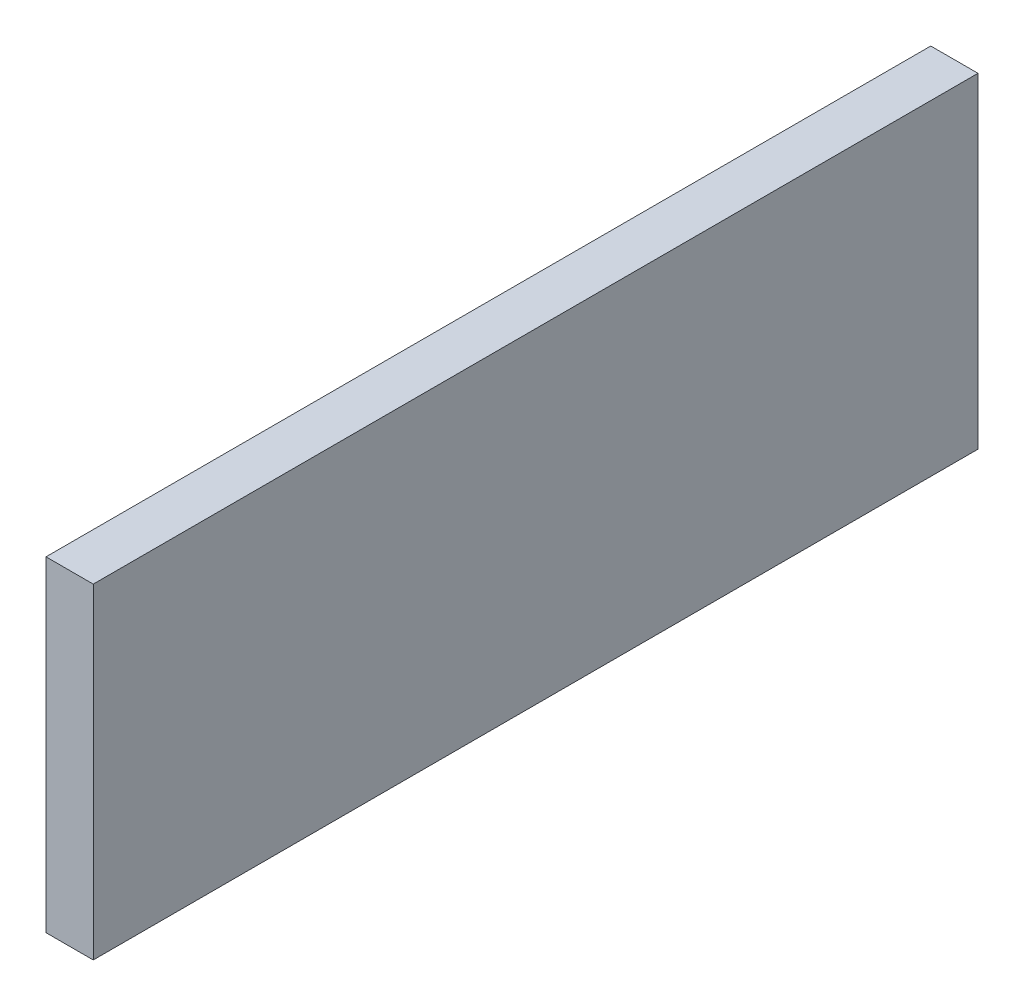
ISO-10303-21;
HEADER;
FILE_DESCRIPTION(('STEP AP214'),'2;1');
FILE_NAME('part.step','',(''),(''),'','','');
FILE_SCHEMA(('AUTOMOTIVE_DESIGN { 1 0 10303 214 1 1 1 1 }'));
ENDSEC;
DATA;
#1=APPLICATION_CONTEXT('core data for automotive mechanical design processes');
#2=APPLICATION_PROTOCOL_DEFINITION('international standard','automotive_design',2000,#1);
#3=PRODUCT_CONTEXT('',#1,'mechanical');
#4=PRODUCT('Part','Part','',(#3));
#5=PRODUCT_RELATED_PRODUCT_CATEGORY('part','',(#4));
#6=PRODUCT_DEFINITION_FORMATION('','',#4);
#7=PRODUCT_DEFINITION_CONTEXT('part definition',#1,'design');
#8=PRODUCT_DEFINITION('design','',#6,#7);
#9=PRODUCT_DEFINITION_SHAPE('','',#8);
#10=(LENGTH_UNIT() NAMED_UNIT(*) SI_UNIT(.MILLI.,.METRE.));
#11=(NAMED_UNIT(*) PLANE_ANGLE_UNIT() SI_UNIT($,.RADIAN.));
#12=(NAMED_UNIT(*) SI_UNIT($,.STERADIAN.) SOLID_ANGLE_UNIT());
#13=UNCERTAINTY_MEASURE_WITH_UNIT(LENGTH_MEASURE(1.E-05),#10,'distance_accuracy_value','');
#14=(GEOMETRIC_REPRESENTATION_CONTEXT(3) GLOBAL_UNCERTAINTY_ASSIGNED_CONTEXT((#13)) GLOBAL_UNIT_ASSIGNED_CONTEXT((#10,
#11,#12)) REPRESENTATION_CONTEXT('',''));
#15=CARTESIAN_POINT('',(0.,0.,0.));
#16=DIRECTION('',(0.,0.,1.));
#17=DIRECTION('',(1.,0.,0.));
#18=AXIS2_PLACEMENT_3D('',#15,#16,#17);
#19=CARTESIAN_POINT('',(18.,15.673494061066,31.6515286925652));
#20=DIRECTION('',(0.,0.,-1.));
#21=DIRECTION('',(0.,1.,0.));
#22=AXIS2_PLACEMENT_3D('',#19,#20,#21);
#23=PLANE('',#22);
#24=DIRECTION('',(0.,-1.,0.));
#25=VECTOR('',#24,1.);
#26=CARTESIAN_POINT('',(0.,15.673494061066,31.6515286925652));
#27=LINE('',#26,#25);
#28=CARTESIAN_POINT('',(0.,15.673494061066,31.6515286925652));
#29=VERTEX_POINT('',#28);
#30=CARTESIAN_POINT('',(0.,-108.326505938934,31.6515286925652));
#31=VERTEX_POINT('',#30);
#32=EDGE_CURVE('E98',#29,#31,#27,.T.);
#33=ORIENTED_EDGE('',*,*,#32,.T.);
#34=DIRECTION('',(-1.,0.,0.));
#35=VECTOR('',#34,1.);
#36=CARTESIAN_POINT('',(18.,-108.326505938934,31.6515286925652));
#37=LINE('',#36,#35);
#38=CARTESIAN_POINT('',(18.,-108.326505938934,31.6515286925652));
#39=VERTEX_POINT('',#38);
#40=EDGE_CURVE('E11',#39,#31,#37,.T.);
#41=ORIENTED_EDGE('',*,*,#40,.F.);
#42=DIRECTION('',(0.,-1.,0.));
#43=VECTOR('',#42,1.);
#44=CARTESIAN_POINT('',(18.,15.673494061066,31.6515286925652));
#45=LINE('',#44,#43);
#46=CARTESIAN_POINT('',(18.,15.673494061066,31.6515286925652));
#47=VERTEX_POINT('',#46);
#48=EDGE_CURVE('E86',#47,#39,#45,.T.);
#49=ORIENTED_EDGE('',*,*,#48,.F.);
#50=DIRECTION('',(-1.,0.,0.));
#51=VECTOR('',#50,1.);
#52=CARTESIAN_POINT('',(18.,15.673494061066,31.6515286925652));
#53=LINE('',#52,#51);
#54=EDGE_CURVE('E94',#47,#29,#53,.T.);
#55=ORIENTED_EDGE('',*,*,#54,.T.);
#56=EDGE_LOOP('',(#33,#41,#49,#55));
#57=FACE_BOUND('',#56,.T.);
#58=ADVANCED_FACE('F35',(#57),#23,.F.);
#59=CARTESIAN_POINT('',(18.,-108.326505938934,31.6515286925652));
#60=DIRECTION('',(0.,1.,0.));
#61=DIRECTION('',(0.,0.,1.));
#62=AXIS2_PLACEMENT_3D('',#59,#60,#61);
#63=PLANE('',#62);
#64=DIRECTION('',(0.,0.,-1.));
#65=VECTOR('',#64,1.);
#66=CARTESIAN_POINT('',(0.,-108.326505938934,31.6515286925652));
#67=LINE('',#66,#65);
#68=CARTESIAN_POINT('',(0.,-108.326505938934,-305.348471307435));
#69=VERTEX_POINT('',#68);
#70=EDGE_CURVE('E90',#31,#69,#67,.T.);
#71=ORIENTED_EDGE('',*,*,#70,.T.);
#72=DIRECTION('',(-1.,0.,0.));
#73=VECTOR('',#72,1.);
#74=CARTESIAN_POINT('',(18.,-108.326505938934,-305.348471307435));
#75=LINE('',#74,#73);
#76=CARTESIAN_POINT('',(18.,-108.326505938934,-305.348471307435));
#77=VERTEX_POINT('',#76);
#78=EDGE_CURVE('E43',#77,#69,#75,.T.);
#79=ORIENTED_EDGE('',*,*,#78,.F.);
#80=DIRECTION('',(0.,0.,-1.));
#81=VECTOR('',#80,1.);
#82=CARTESIAN_POINT('',(18.,-108.326505938934,31.6515286925652));
#83=LINE('',#82,#81);
#84=EDGE_CURVE('E81',#39,#77,#83,.T.);
#85=ORIENTED_EDGE('',*,*,#84,.F.);
#86=ORIENTED_EDGE('',*,*,#40,.T.);
#87=EDGE_LOOP('',(#71,#79,#85,#86));
#88=FACE_BOUND('',#87,.T.);
#89=ADVANCED_FACE('F89',(#88),#63,.F.);
#90=CARTESIAN_POINT('',(18.,15.673494061066,-305.348471307435));
#91=DIRECTION('',(0.,0.,1.));
#92=DIRECTION('',(1.,0.,0.));
#93=AXIS2_PLACEMENT_3D('',#90,#91,#92);
#94=PLANE('',#93);
#95=DIRECTION('',(0.,1.,0.));
#96=VECTOR('',#95,1.);
#97=CARTESIAN_POINT('',(0.,15.673494061066,-305.348471307435));
#98=LINE('',#97,#96);
#99=CARTESIAN_POINT('',(0.,15.673494061066,-305.348471307435));
#100=VERTEX_POINT('',#99);
#101=EDGE_CURVE('E68',#69,#100,#98,.T.);
#102=ORIENTED_EDGE('',*,*,#101,.T.);
#103=DIRECTION('',(-1.,0.,0.));
#104=VECTOR('',#103,1.);
#105=CARTESIAN_POINT('',(18.,15.673494061066,-305.348471307435));
#106=LINE('',#105,#104);
#107=CARTESIAN_POINT('',(18.,15.673494061066,-305.348471307435));
#108=VERTEX_POINT('',#107);
#109=EDGE_CURVE('E91',#108,#100,#106,.T.);
#110=ORIENTED_EDGE('',*,*,#109,.F.);
#111=DIRECTION('',(0.,1.,0.));
#112=VECTOR('',#111,1.);
#113=CARTESIAN_POINT('',(18.,15.673494061066,-305.348471307435));
#114=LINE('',#113,#112);
#115=EDGE_CURVE('E84',#77,#108,#114,.T.);
#116=ORIENTED_EDGE('',*,*,#115,.F.);
#117=ORIENTED_EDGE('',*,*,#78,.T.);
#118=EDGE_LOOP('',(#102,#110,#116,#117));
#119=FACE_BOUND('',#118,.T.);
#120=ADVANCED_FACE('F92',(#119),#94,.F.);
#121=CARTESIAN_POINT('',(18.,15.673494061066,31.6515286925652));
#122=DIRECTION('',(0.,-1.,0.));
#123=DIRECTION('',(0.,0.,-1.));
#124=AXIS2_PLACEMENT_3D('',#121,#122,#123);
#125=PLANE('',#124);
#126=DIRECTION('',(0.,0.,1.));
#127=VECTOR('',#126,1.);
#128=CARTESIAN_POINT('',(0.,15.673494061066,31.6515286925652));
#129=LINE('',#128,#127);
#130=EDGE_CURVE('E74',#100,#29,#129,.T.);
#131=ORIENTED_EDGE('',*,*,#130,.T.);
#132=ORIENTED_EDGE('',*,*,#54,.F.);
#133=DIRECTION('',(0.,0.,1.));
#134=VECTOR('',#133,1.);
#135=CARTESIAN_POINT('',(18.,15.673494061066,31.6515286925652));
#136=LINE('',#135,#134);
#137=EDGE_CURVE('E51',#108,#47,#136,.T.);
#138=ORIENTED_EDGE('',*,*,#137,.F.);
#139=ORIENTED_EDGE('',*,*,#109,.T.);
#140=EDGE_LOOP('',(#131,#132,#138,#139));
#141=FACE_BOUND('',#140,.T.);
#142=ADVANCED_FACE('F105',(#141),#125,.F.);
#143=CARTESIAN_POINT('',(18.,0.,0.));
#144=DIRECTION('',(1.,0.,0.));
#145=DIRECTION('',(0.,0.,-1.));
#146=AXIS2_PLACEMENT_3D('',#143,#144,#145);
#147=PLANE('',#146);
#148=ORIENTED_EDGE('',*,*,#48,.T.);
#149=ORIENTED_EDGE('',*,*,#84,.T.);
#150=ORIENTED_EDGE('',*,*,#115,.T.);
#151=ORIENTED_EDGE('',*,*,#137,.T.);
#152=EDGE_LOOP('',(#148,#149,#150,#151));
#153=FACE_BOUND('',#152,.T.);
#154=ADVANCED_FACE('F82',(#153),#147,.T.);
#155=CARTESIAN_POINT('',(0.,0.,0.));
#156=DIRECTION('',(1.,0.,0.));
#157=DIRECTION('',(0.,0.,-1.));
#158=AXIS2_PLACEMENT_3D('',#155,#156,#157);
#159=PLANE('',#158);
#160=ORIENTED_EDGE('',*,*,#32,.F.);
#161=ORIENTED_EDGE('',*,*,#130,.F.);
#162=ORIENTED_EDGE('',*,*,#101,.F.);
#163=ORIENTED_EDGE('',*,*,#70,.F.);
#164=EDGE_LOOP('',(#160,#161,#162,#163));
#165=FACE_BOUND('',#164,.T.);
#166=ADVANCED_FACE('F108',(#165),#159,.F.);
#167=CLOSED_SHELL('',(#58,#89,#120,#142,#154,#166));
#168=MANIFOLD_SOLID_BREP('B2',#167);
#169=ADVANCED_BREP_SHAPE_REPRESENTATION('',(#18,#168),#14);
#170=SHAPE_DEFINITION_REPRESENTATION(#9,#169);
ENDSEC;
END-ISO-10303-21;
